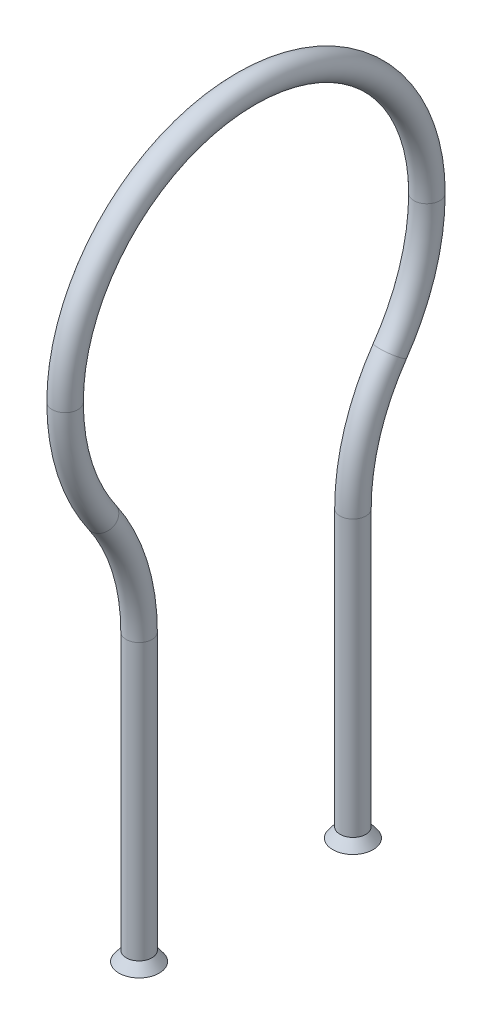
ISO-10303-21;
HEADER;
FILE_DESCRIPTION(('STEP AP214'),'2;1');
FILE_NAME('part.step','',(''),(''),'','','');
FILE_SCHEMA(('AUTOMOTIVE_DESIGN { 1 0 10303 214 1 1 1 1 }'));
ENDSEC;
DATA;
#1=APPLICATION_CONTEXT('core data for automotive mechanical design processes');
#2=APPLICATION_PROTOCOL_DEFINITION('international standard','automotive_design',2000,#1);
#3=PRODUCT_CONTEXT('',#1,'mechanical');
#4=PRODUCT('Part','Part','',(#3));
#5=PRODUCT_RELATED_PRODUCT_CATEGORY('part','',(#4));
#6=PRODUCT_DEFINITION_FORMATION('','',#4);
#7=PRODUCT_DEFINITION_CONTEXT('part definition',#1,'design');
#8=PRODUCT_DEFINITION('design','',#6,#7);
#9=PRODUCT_DEFINITION_SHAPE('','',#8);
#10=(LENGTH_UNIT() NAMED_UNIT(*) SI_UNIT(.MILLI.,.METRE.));
#11=(NAMED_UNIT(*) PLANE_ANGLE_UNIT() SI_UNIT($,.RADIAN.));
#12=(NAMED_UNIT(*) SI_UNIT($,.STERADIAN.) SOLID_ANGLE_UNIT());
#13=UNCERTAINTY_MEASURE_WITH_UNIT(LENGTH_MEASURE(1.E-05),#10,'distance_accuracy_value','');
#14=(GEOMETRIC_REPRESENTATION_CONTEXT(3) GLOBAL_UNCERTAINTY_ASSIGNED_CONTEXT((#13)) GLOBAL_UNIT_ASSIGNED_CONTEXT((#10,
#11,#12)) REPRESENTATION_CONTEXT('',''));
#15=CARTESIAN_POINT('',(0.,0.,0.));
#16=DIRECTION('',(0.,0.,1.));
#17=DIRECTION('',(1.,0.,0.));
#18=AXIS2_PLACEMENT_3D('',#15,#16,#17);
#19=CARTESIAN_POINT('',(0.,-129.413721935553,-19.7022239940001));
#20=DIRECTION('',(0.,-1.,0.));
#21=DIRECTION('',(0.,0.,1.));
#22=AXIS2_PLACEMENT_3D('',#19,#20,#21);
#23=PLANE('',#22);
#24=CARTESIAN_POINT('',(0.,-129.413721935553,-19.7022239940001));
#25=DIRECTION('',(0.,-1.,0.));
#26=DIRECTION('',(0.,0.,-1.));
#27=AXIS2_PLACEMENT_3D('',#24,#25,#26);
#28=CIRCLE('',#27,3.72106910108277);
#29=CARTESIAN_POINT('',(0.,-129.413721935553,-23.4232930950829));
#30=VERTEX_POINT('',#29);
#31=EDGE_CURVE('E88',#30,#30,#28,.F.);
#32=ORIENTED_EDGE('',*,*,#31,.F.);
#33=EDGE_LOOP('',(#32));
#34=FACE_BOUND('',#33,.T.);
#35=CARTESIAN_POINT('',(0.,-129.413721935553,-19.702223994));
#36=DIRECTION('',(0.,1.,0.));
#37=DIRECTION('',(0.,0.,1.));
#38=AXIS2_PLACEMENT_3D('',#35,#36,#37);
#39=CIRCLE('',#38,3.16226910108277);
#40=CARTESIAN_POINT('',(0.,-129.413721935553,-16.5399548929172));
#41=VERTEX_POINT('',#40);
#42=EDGE_CURVE('E94',#41,#41,#39,.F.);
#43=ORIENTED_EDGE('',*,*,#42,.F.);
#44=EDGE_LOOP('',(#43));
#45=FACE_BOUND('',#44,.T.);
#46=ADVANCED_FACE('F32',(#34,#45),#23,.T.);
#47=CARTESIAN_POINT('',(0.,-76.8357219355527,19.702223994));
#48=DIRECTION('',(0.,-1.,0.));
#49=DIRECTION('',(0.,0.,-1.));
#50=AXIS2_PLACEMENT_3D('',#47,#48,#49);
#51=CYLINDRICAL_SURFACE('',#50,2.38125);
#52=CARTESIAN_POINT('',(0.,-76.8357219355527,19.702223994));
#53=DIRECTION('',(0.,-1.,0.));
#54=DIRECTION('',(1.,0.,0.));
#55=AXIS2_PLACEMENT_3D('',#52,#53,#54);
#56=CIRCLE('',#55,2.38125);
#57=CARTESIAN_POINT('',(0.,-76.8357219355527,17.320973994));
#58=VERTEX_POINT('',#57);
#59=EDGE_CURVE('E39',#58,#58,#56,.T.);
#60=ORIENTED_EDGE('',*,*,#59,.T.);
#61=EDGE_LOOP('',(#60));
#62=FACE_BOUND('',#61,.T.);
#63=CARTESIAN_POINT('',(0.,-127.635721935553,19.702223994));
#64=DIRECTION('',(0.,-1.,0.));
#65=DIRECTION('',(1.,0.,0.));
#66=AXIS2_PLACEMENT_3D('',#63,#64,#65);
#67=CIRCLE('',#66,2.38125);
#68=CARTESIAN_POINT('',(2.38125,-127.635721935553,19.702223994));
#69=VERTEX_POINT('',#68);
#70=EDGE_CURVE('E10',#69,#69,#67,.T.);
#71=ORIENTED_EDGE('',*,*,#70,.F.);
#72=EDGE_LOOP('',(#71));
#73=FACE_BOUND('',#72,.T.);
#74=ADVANCED_FACE('F34',(#62,#73),#51,.T.);
#75=CARTESIAN_POINT('',(0.,-76.8357219355527,19.702223994));
#76=DIRECTION('',(0.,-1.,0.));
#77=DIRECTION('',(0.,0.,-1.));
#78=AXIS2_PLACEMENT_3D('',#75,#76,#77);
#79=CYLINDRICAL_SURFACE('',#78,1.82245);
#80=CARTESIAN_POINT('',(0.,-76.8357219355527,19.702223994));
#81=DIRECTION('',(0.,-1.,0.));
#82=DIRECTION('',(1.,0.,0.));
#83=AXIS2_PLACEMENT_3D('',#80,#81,#82);
#84=CIRCLE('',#83,1.82245);
#85=CARTESIAN_POINT('',(0.,-76.8357219355527,17.879773994));
#86=VERTEX_POINT('',#85);
#87=EDGE_CURVE('E43',#86,#86,#84,.T.);
#88=ORIENTED_EDGE('',*,*,#87,.F.);
#89=EDGE_LOOP('',(#88));
#90=FACE_BOUND('',#89,.T.);
#91=CARTESIAN_POINT('',(0.,-127.635721935553,19.702223994));
#92=DIRECTION('',(0.,1.,0.));
#93=DIRECTION('',(0.,0.,1.));
#94=AXIS2_PLACEMENT_3D('',#91,#92,#93);
#95=CIRCLE('',#94,1.82245);
#96=CARTESIAN_POINT('',(0.,-127.635721935553,21.524673994));
#97=VERTEX_POINT('',#96);
#98=EDGE_CURVE('E67',#97,#97,#95,.T.);
#99=ORIENTED_EDGE('',*,*,#98,.F.);
#100=EDGE_LOOP('',(#99));
#101=FACE_BOUND('',#100,.T.);
#102=ADVANCED_FACE('F120',(#90,#101),#79,.F.);
#103=CARTESIAN_POINT('',(0.,-76.8357219355528,57.802223994));
#104=DIRECTION('',(-1.,0.,0.));
#105=DIRECTION('',(0.,0.,1.));
#106=AXIS2_PLACEMENT_3D('',#103,#104,#105);
#107=TOROIDAL_SURFACE('',#106,38.1,2.38125);
#108=CARTESIAN_POINT('',(0.,-55.0866109677763,26.519861997));
#109=DIRECTION('',(0.,-0.82105937,-0.570842807553185));
#110=DIRECTION('',(1.,0.,0.));
#111=AXIS2_PLACEMENT_3D('',#108,#109,#110);
#112=CIRCLE('',#111,2.38125);
#113=CARTESIAN_POINT('',(0.,-53.7272915322903,24.5647143721875));
#114=VERTEX_POINT('',#113);
#115=EDGE_CURVE('E47',#114,#114,#112,.T.);
#116=CARTESIAN_POINT('',(0.,-76.8357219355528,57.802223994));
#117=DIRECTION('',(-1.,0.,0.));
#118=DIRECTION('',(0.,0.,1.));
#119=AXIS2_PLACEMENT_3D('',#116,#117,#118);
#120=CIRCLE('',#119,40.48125);
#121=EDGE_CURVE('',#114,#58,#120,.T.);
#122=ORIENTED_EDGE('',*,*,#115,.T.);
#123=ORIENTED_EDGE('',*,*,#59,.F.);
#124=ORIENTED_EDGE('',*,*,#121,.T.);
#125=ORIENTED_EDGE('',*,*,#121,.F.);
#126=EDGE_LOOP('',(#122,#124,#123,#125));
#127=FACE_BOUND('',#126,.T.);
#128=ADVANCED_FACE('F177',(#127),#107,.T.);
#129=CARTESIAN_POINT('',(0.,-76.8357219355528,57.802223994));
#130=DIRECTION('',(-1.,0.,0.));
#131=DIRECTION('',(0.,0.,1.));
#132=AXIS2_PLACEMENT_3D('',#129,#130,#131);
#133=TOROIDAL_SURFACE('',#132,38.1,1.82245);
#134=CARTESIAN_POINT('',(0.,-55.0866109677763,26.519861997));
#135=DIRECTION('',(0.,-0.82105937,-0.570842807553185));
#136=DIRECTION('',(1.,0.,0.));
#137=AXIS2_PLACEMENT_3D('',#134,#135,#136);
#138=CIRCLE('',#137,1.82245);
#139=CARTESIAN_POINT('',(0.,-54.046278493151,25.0235223481435));
#140=VERTEX_POINT('',#139);
#141=EDGE_CURVE('E52',#140,#140,#138,.T.);
#142=CARTESIAN_POINT('',(0.,-76.8357219355528,57.802223994));
#143=DIRECTION('',(-1.,0.,0.));
#144=DIRECTION('',(0.,0.,1.));
#145=AXIS2_PLACEMENT_3D('',#142,#143,#144);
#146=CIRCLE('',#145,39.92245);
#147=EDGE_CURVE('',#140,#86,#146,.T.);
#148=ORIENTED_EDGE('',*,*,#141,.F.);
#149=ORIENTED_EDGE('',*,*,#87,.T.);
#150=ORIENTED_EDGE('',*,*,#147,.T.);
#151=ORIENTED_EDGE('',*,*,#147,.F.);
#152=EDGE_LOOP('',(#148,#150,#149,#151));
#153=FACE_BOUND('',#152,.T.);
#154=ADVANCED_FACE('F173',(#153),#133,.F.);
#155=CARTESIAN_POINT('',(0.,-33.3375,-4.7625));
#156=DIRECTION('',(1.,0.,0.));
#157=DIRECTION('',(0.,0.,-1.));
#158=AXIS2_PLACEMENT_3D('',#155,#156,#157);
#159=TOROIDAL_SURFACE('',#158,38.1,2.38125);
#160=CARTESIAN_POINT('',(0.,-33.3375,33.3375));
#161=DIRECTION('',(0.,-1.,0.));
#162=DIRECTION('',(1.,0.,0.));
#163=AXIS2_PLACEMENT_3D('',#160,#161,#162);
#164=CIRCLE('',#163,2.38125);
#165=CARTESIAN_POINT('',(0.,-33.3375,35.71875));
#166=VERTEX_POINT('',#165);
#167=EDGE_CURVE('E55',#166,#166,#164,.T.);
#168=ORIENTED_EDGE('',*,*,#167,.T.);
#169=EDGE_LOOP('',(#168));
#170=FACE_BOUND('',#169,.T.);
#171=ORIENTED_EDGE('',*,*,#115,.F.);
#172=EDGE_LOOP('',(#171));
#173=FACE_BOUND('',#172,.T.);
#174=ADVANCED_FACE('F169',(#170,#173),#159,.T.);
#175=CARTESIAN_POINT('',(0.,-33.3375,-4.7625));
#176=DIRECTION('',(1.,0.,0.));
#177=DIRECTION('',(0.,0.,-1.));
#178=AXIS2_PLACEMENT_3D('',#175,#176,#177);
#179=TOROIDAL_SURFACE('',#178,38.1,1.82245);
#180=CARTESIAN_POINT('',(0.,-33.3375,33.3375));
#181=DIRECTION('',(0.,-1.,0.));
#182=DIRECTION('',(1.,0.,0.));
#183=AXIS2_PLACEMENT_3D('',#180,#181,#182);
#184=CIRCLE('',#183,1.82245);
#185=CARTESIAN_POINT('',(0.,-33.3375,35.15995));
#186=VERTEX_POINT('',#185);
#187=EDGE_CURVE('E58',#186,#186,#184,.T.);
#188=ORIENTED_EDGE('',*,*,#187,.F.);
#189=EDGE_LOOP('',(#188));
#190=FACE_BOUND('',#189,.T.);
#191=ORIENTED_EDGE('',*,*,#141,.T.);
#192=EDGE_LOOP('',(#191));
#193=FACE_BOUND('',#192,.T.);
#194=ADVANCED_FACE('F162',(#190,#193),#179,.F.);
#195=CARTESIAN_POINT('',(0.,-33.3375,0.));
#196=DIRECTION('',(-1.,0.,0.));
#197=DIRECTION('',(0.,0.,1.));
#198=AXIS2_PLACEMENT_3D('',#195,#196,#197);
#199=TOROIDAL_SURFACE('',#198,33.3375,1.82245);
#200=CARTESIAN_POINT('',(0.,-33.3375,-33.3375));
#201=DIRECTION('',(0.,1.,0.));
#202=DIRECTION('',(1.,0.,0.));
#203=AXIS2_PLACEMENT_3D('',#200,#201,#202);
#204=CIRCLE('',#203,1.82245);
#205=CARTESIAN_POINT('',(0.,-33.3375,-35.15995));
#206=VERTEX_POINT('',#205);
#207=EDGE_CURVE('E85',#206,#206,#204,.T.);
#208=CARTESIAN_POINT('',(0.,-33.3375,0.));
#209=DIRECTION('',(-1.,0.,0.));
#210=DIRECTION('',(0.,0.,1.));
#211=AXIS2_PLACEMENT_3D('',#208,#209,#210);
#212=CIRCLE('',#211,35.15995);
#213=EDGE_CURVE('',#186,#206,#212,.T.);
#214=ORIENTED_EDGE('',*,*,#187,.T.);
#215=ORIENTED_EDGE('',*,*,#207,.F.);
#216=ORIENTED_EDGE('',*,*,#213,.T.);
#217=ORIENTED_EDGE('',*,*,#213,.F.);
#218=EDGE_LOOP('',(#214,#216,#215,#217));
#219=FACE_BOUND('',#218,.T.);
#220=ADVANCED_FACE('F159',(#219),#199,.F.);
#221=CARTESIAN_POINT('',(0.,-33.3375,0.));
#222=DIRECTION('',(-1.,0.,0.));
#223=DIRECTION('',(0.,0.,1.));
#224=AXIS2_PLACEMENT_3D('',#221,#222,#223);
#225=TOROIDAL_SURFACE('',#224,33.3375,2.38125);
#226=CARTESIAN_POINT('',(0.,-33.3375,-33.3375));
#227=DIRECTION('',(0.,1.,0.));
#228=DIRECTION('',(1.,0.,0.));
#229=AXIS2_PLACEMENT_3D('',#226,#227,#228);
#230=CIRCLE('',#229,2.38125);
#231=CARTESIAN_POINT('',(0.,-33.3375,-35.71875));
#232=VERTEX_POINT('',#231);
#233=EDGE_CURVE('E82',#232,#232,#230,.T.);
#234=CARTESIAN_POINT('',(0.,-33.3375,0.));
#235=DIRECTION('',(-1.,0.,0.));
#236=DIRECTION('',(0.,0.,1.));
#237=AXIS2_PLACEMENT_3D('',#234,#235,#236);
#238=CIRCLE('',#237,35.71875);
#239=EDGE_CURVE('',#166,#232,#238,.T.);
#240=ORIENTED_EDGE('',*,*,#167,.F.);
#241=ORIENTED_EDGE('',*,*,#233,.T.);
#242=ORIENTED_EDGE('',*,*,#239,.T.);
#243=ORIENTED_EDGE('',*,*,#239,.F.);
#244=EDGE_LOOP('',(#240,#242,#241,#243));
#245=FACE_BOUND('',#244,.T.);
#246=ADVANCED_FACE('F154',(#245),#225,.T.);
#247=CARTESIAN_POINT('',(0.,-129.413721935553,19.7022239940001));
#248=DIRECTION('',(0.,-1.,0.));
#249=DIRECTION('',(0.,0.,-1.));
#250=AXIS2_PLACEMENT_3D('',#247,#248,#249);
#251=PLANE('',#250);
#252=CARTESIAN_POINT('',(0.,-129.413721935553,19.702223994));
#253=DIRECTION('',(0.,1.,0.));
#254=DIRECTION('',(0.,0.,1.));
#255=AXIS2_PLACEMENT_3D('',#252,#253,#254);
#256=CIRCLE('',#255,3.16226910108277);
#257=CARTESIAN_POINT('',(0.,-129.413721935553,22.8644930950828));
#258=VERTEX_POINT('',#257);
#259=EDGE_CURVE('E64',#258,#258,#256,.T.);
#260=ORIENTED_EDGE('',*,*,#259,.T.);
#261=EDGE_LOOP('',(#260));
#262=FACE_BOUND('',#261,.T.);
#263=CARTESIAN_POINT('',(0.,-129.413721935553,19.7022239940001));
#264=DIRECTION('',(0.,-1.,0.));
#265=DIRECTION('',(0.,0.,-1.));
#266=AXIS2_PLACEMENT_3D('',#263,#264,#265);
#267=CIRCLE('',#266,3.72106910108277);
#268=CARTESIAN_POINT('',(0.,-129.413721935553,15.9811548929174));
#269=VERTEX_POINT('',#268);
#270=EDGE_CURVE('E61',#269,#269,#267,.T.);
#271=ORIENTED_EDGE('',*,*,#270,.T.);
#272=EDGE_LOOP('',(#271));
#273=FACE_BOUND('',#272,.T.);
#274=ADVANCED_FACE('F151',(#262,#273),#251,.T.);
#275=CARTESIAN_POINT('',(0.,-127.635721935553,19.7022239940001));
#276=DIRECTION('',(0.,-1.,0.));
#277=DIRECTION('',(0.,0.,-1.));
#278=AXIS2_PLACEMENT_3D('',#275,#276,#277);
#279=CONICAL_SURFACE('',#278,2.38125,0.645771823237903);
#280=ORIENTED_EDGE('',*,*,#270,.F.);
#281=EDGE_LOOP('',(#280));
#282=FACE_BOUND('',#281,.T.);
#283=ORIENTED_EDGE('',*,*,#70,.T.);
#284=EDGE_LOOP('',(#283));
#285=FACE_BOUND('',#284,.T.);
#286=ADVANCED_FACE('F149',(#282,#285),#279,.T.);
#287=CARTESIAN_POINT('',(0.,-127.635721935553,19.702223994));
#288=DIRECTION('',(0.,-1.,0.));
#289=DIRECTION('',(0.,0.,1.));
#290=AXIS2_PLACEMENT_3D('',#287,#288,#289);
#291=CONICAL_SURFACE('',#290,1.82245,0.645771823237903);
#292=ORIENTED_EDGE('',*,*,#259,.F.);
#293=EDGE_LOOP('',(#292));
#294=FACE_BOUND('',#293,.T.);
#295=ORIENTED_EDGE('',*,*,#98,.T.);
#296=EDGE_LOOP('',(#295));
#297=FACE_BOUND('',#296,.T.);
#298=ADVANCED_FACE('F145',(#294,#297),#291,.F.);
#299=CARTESIAN_POINT('',(0.,-76.8357219355527,-19.702223994));
#300=DIRECTION('',(0.,-1.,0.));
#301=DIRECTION('',(0.,0.,-1.));
#302=AXIS2_PLACEMENT_3D('',#299,#300,#301);
#303=CYLINDRICAL_SURFACE('',#302,2.38125);
#304=CARTESIAN_POINT('',(0.,-76.8357219355527,-19.702223994));
#305=DIRECTION('',(0.,1.,0.));
#306=DIRECTION('',(1.,0.,0.));
#307=AXIS2_PLACEMENT_3D('',#304,#305,#306);
#308=CIRCLE('',#307,2.38125);
#309=CARTESIAN_POINT('',(0.,-76.8357219355527,-17.320973994));
#310=VERTEX_POINT('',#309);
#311=EDGE_CURVE('E70',#310,#310,#308,.T.);
#312=ORIENTED_EDGE('',*,*,#311,.F.);
#313=EDGE_LOOP('',(#312));
#314=FACE_BOUND('',#313,.T.);
#315=CARTESIAN_POINT('',(0.,-127.635721935553,-19.7022239940001));
#316=DIRECTION('',(0.,1.,0.));
#317=DIRECTION('',(0.,0.,1.));
#318=AXIS2_PLACEMENT_3D('',#315,#316,#317);
#319=CIRCLE('',#318,2.38125);
#320=CARTESIAN_POINT('',(0.,-127.635721935553,-17.3209739940001));
#321=VERTEX_POINT('',#320);
#322=EDGE_CURVE('E91',#321,#321,#319,.T.);
#323=ORIENTED_EDGE('',*,*,#322,.T.);
#324=EDGE_LOOP('',(#323));
#325=FACE_BOUND('',#324,.T.);
#326=ADVANCED_FACE('F141',(#314,#325),#303,.T.);
#327=CARTESIAN_POINT('',(0.,-76.8357219355527,-19.702223994));
#328=DIRECTION('',(0.,-1.,0.));
#329=DIRECTION('',(0.,0.,-1.));
#330=AXIS2_PLACEMENT_3D('',#327,#328,#329);
#331=CYLINDRICAL_SURFACE('',#330,1.82245);
#332=CARTESIAN_POINT('',(0.,-76.8357219355527,-19.702223994));
#333=DIRECTION('',(0.,1.,0.));
#334=DIRECTION('',(1.,0.,0.));
#335=AXIS2_PLACEMENT_3D('',#332,#333,#334);
#336=CIRCLE('',#335,1.82245);
#337=CARTESIAN_POINT('',(0.,-76.8357219355527,-17.879773994));
#338=VERTEX_POINT('',#337);
#339=EDGE_CURVE('E73',#338,#338,#336,.T.);
#340=ORIENTED_EDGE('',*,*,#339,.T.);
#341=EDGE_LOOP('',(#340));
#342=FACE_BOUND('',#341,.T.);
#343=CARTESIAN_POINT('',(0.,-127.635721935553,-19.702223994));
#344=DIRECTION('',(0.,-1.,0.));
#345=DIRECTION('',(0.,0.,-1.));
#346=AXIS2_PLACEMENT_3D('',#343,#344,#345);
#347=CIRCLE('',#346,1.82245);
#348=CARTESIAN_POINT('',(0.,-127.635721935553,-21.524673994));
#349=VERTEX_POINT('',#348);
#350=EDGE_CURVE('E97',#349,#349,#347,.T.);
#351=ORIENTED_EDGE('',*,*,#350,.T.);
#352=EDGE_LOOP('',(#351));
#353=FACE_BOUND('',#352,.T.);
#354=ADVANCED_FACE('F101',(#342,#353),#331,.F.);
#355=CARTESIAN_POINT('',(0.,-76.8357219355528,-57.802223994));
#356=DIRECTION('',(1.,0.,0.));
#357=DIRECTION('',(0.,0.,-1.));
#358=AXIS2_PLACEMENT_3D('',#355,#356,#357);
#359=TOROIDAL_SURFACE('',#358,38.1,2.38125);
#360=CARTESIAN_POINT('',(0.,-55.0866109677763,-26.519861997));
#361=DIRECTION('',(0.,0.82105937,-0.570842807553185));
#362=DIRECTION('',(1.,0.,0.));
#363=AXIS2_PLACEMENT_3D('',#360,#361,#362);
#364=CIRCLE('',#363,2.38125);
#365=CARTESIAN_POINT('',(0.,-53.7272915322903,-24.5647143721875));
#366=VERTEX_POINT('',#365);
#367=EDGE_CURVE('E76',#366,#366,#364,.T.);
#368=CARTESIAN_POINT('',(0.,-76.8357219355528,-57.802223994));
#369=DIRECTION('',(1.,0.,0.));
#370=DIRECTION('',(0.,0.,-1.));
#371=AXIS2_PLACEMENT_3D('',#368,#369,#370);
#372=CIRCLE('',#371,40.48125);
#373=EDGE_CURVE('',#366,#310,#372,.T.);
#374=ORIENTED_EDGE('',*,*,#367,.F.);
#375=ORIENTED_EDGE('',*,*,#311,.T.);
#376=ORIENTED_EDGE('',*,*,#373,.T.);
#377=ORIENTED_EDGE('',*,*,#373,.F.);
#378=EDGE_LOOP('',(#374,#376,#375,#377));
#379=FACE_BOUND('',#378,.T.);
#380=ADVANCED_FACE('F134',(#379),#359,.T.);
#381=CARTESIAN_POINT('',(0.,-76.8357219355528,-57.802223994));
#382=DIRECTION('',(1.,0.,0.));
#383=DIRECTION('',(0.,0.,-1.));
#384=AXIS2_PLACEMENT_3D('',#381,#382,#383);
#385=TOROIDAL_SURFACE('',#384,38.1,1.82245);
#386=CARTESIAN_POINT('',(0.,-55.0866109677763,-26.519861997));
#387=DIRECTION('',(0.,0.82105937,-0.570842807553185));
#388=DIRECTION('',(1.,0.,0.));
#389=AXIS2_PLACEMENT_3D('',#386,#387,#388);
#390=CIRCLE('',#389,1.82245);
#391=CARTESIAN_POINT('',(0.,-54.046278493151,-25.0235223481435));
#392=VERTEX_POINT('',#391);
#393=EDGE_CURVE('E79',#392,#392,#390,.T.);
#394=CARTESIAN_POINT('',(0.,-76.8357219355528,-57.802223994));
#395=DIRECTION('',(1.,0.,0.));
#396=DIRECTION('',(0.,0.,-1.));
#397=AXIS2_PLACEMENT_3D('',#394,#395,#396);
#398=CIRCLE('',#397,39.92245);
#399=EDGE_CURVE('',#392,#338,#398,.T.);
#400=ORIENTED_EDGE('',*,*,#393,.T.);
#401=ORIENTED_EDGE('',*,*,#339,.F.);
#402=ORIENTED_EDGE('',*,*,#399,.T.);
#403=ORIENTED_EDGE('',*,*,#399,.F.);
#404=EDGE_LOOP('',(#400,#402,#401,#403));
#405=FACE_BOUND('',#404,.T.);
#406=ADVANCED_FACE('F130',(#405),#385,.F.);
#407=CARTESIAN_POINT('',(0.,-33.3375,4.7625));
#408=DIRECTION('',(-1.,0.,0.));
#409=DIRECTION('',(0.,0.,1.));
#410=AXIS2_PLACEMENT_3D('',#407,#408,#409);
#411=TOROIDAL_SURFACE('',#410,38.1,2.38125);
#412=ORIENTED_EDGE('',*,*,#233,.F.);
#413=EDGE_LOOP('',(#412));
#414=FACE_BOUND('',#413,.T.);
#415=ORIENTED_EDGE('',*,*,#367,.T.);
#416=EDGE_LOOP('',(#415));
#417=FACE_BOUND('',#416,.T.);
#418=ADVANCED_FACE('F126',(#414,#417),#411,.T.);
#419=CARTESIAN_POINT('',(0.,-33.3375,4.7625));
#420=DIRECTION('',(-1.,0.,0.));
#421=DIRECTION('',(0.,0.,1.));
#422=AXIS2_PLACEMENT_3D('',#419,#420,#421);
#423=TOROIDAL_SURFACE('',#422,38.1,1.82245);
#424=ORIENTED_EDGE('',*,*,#207,.T.);
#425=EDGE_LOOP('',(#424));
#426=FACE_BOUND('',#425,.T.);
#427=ORIENTED_EDGE('',*,*,#393,.F.);
#428=EDGE_LOOP('',(#427));
#429=FACE_BOUND('',#428,.T.);
#430=ADVANCED_FACE('F111',(#426,#429),#423,.F.);
#431=CARTESIAN_POINT('',(0.,-127.635721935553,-19.7022239940001));
#432=DIRECTION('',(0.,-1.,0.));
#433=DIRECTION('',(0.,0.,1.));
#434=AXIS2_PLACEMENT_3D('',#431,#432,#433);
#435=CONICAL_SURFACE('',#434,2.38125,0.645771823237903);
#436=ORIENTED_EDGE('',*,*,#31,.T.);
#437=EDGE_LOOP('',(#436));
#438=FACE_BOUND('',#437,.T.);
#439=ORIENTED_EDGE('',*,*,#322,.F.);
#440=EDGE_LOOP('',(#439));
#441=FACE_BOUND('',#440,.T.);
#442=ADVANCED_FACE('F105',(#438,#441),#435,.T.);
#443=CARTESIAN_POINT('',(0.,-127.635721935553,-19.702223994));
#444=DIRECTION('',(0.,-1.,0.));
#445=DIRECTION('',(0.,0.,-1.));
#446=AXIS2_PLACEMENT_3D('',#443,#444,#445);
#447=CONICAL_SURFACE('',#446,1.82245,0.645771823237903);
#448=ORIENTED_EDGE('',*,*,#42,.T.);
#449=EDGE_LOOP('',(#448));
#450=FACE_BOUND('',#449,.T.);
#451=ORIENTED_EDGE('',*,*,#350,.F.);
#452=EDGE_LOOP('',(#451));
#453=FACE_BOUND('',#452,.T.);
#454=ADVANCED_FACE('F103',(#450,#453),#447,.F.);
#455=CLOSED_SHELL('',(#46,#74,#102,#128,#154,#174,#194,#220,#246,#274,#286,#298,#326,#354,#380,
#406,#418,#430,#442,#454));
#456=MANIFOLD_SOLID_BREP('B2',#455);
#457=ADVANCED_BREP_SHAPE_REPRESENTATION('',(#18,#456),#14);
#458=SHAPE_DEFINITION_REPRESENTATION(#9,#457);
ENDSEC;
END-ISO-10303-21;
